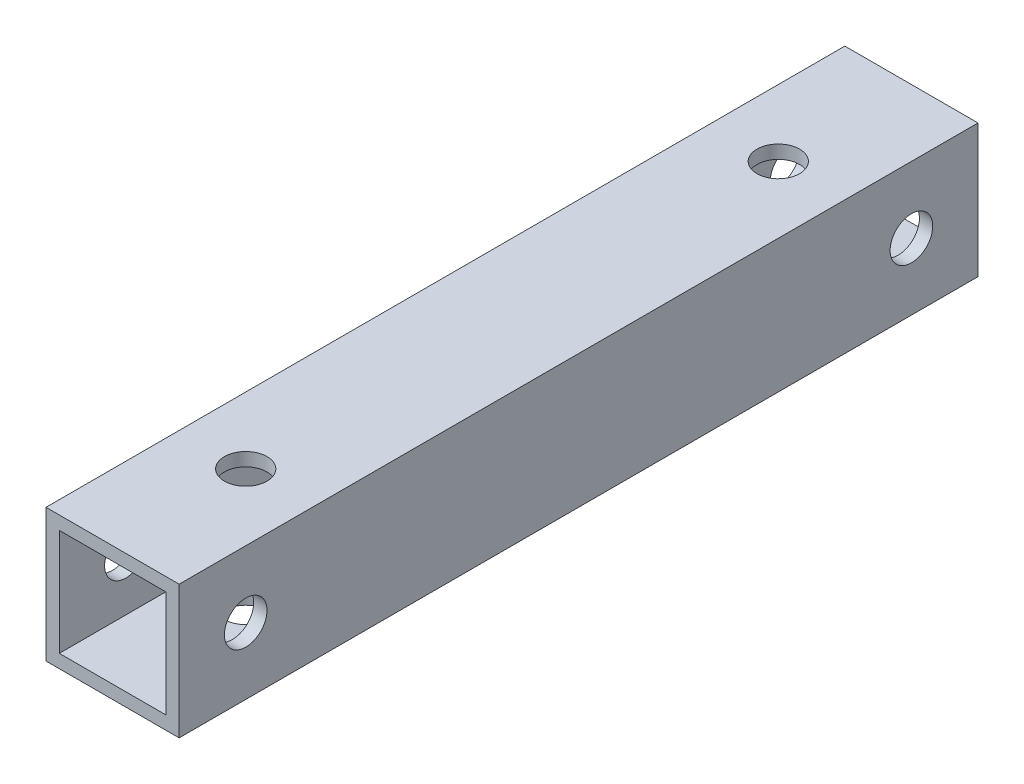
ISO-10303-21;
HEADER;
FILE_DESCRIPTION(('STEP AP214'),'2;1');
FILE_NAME('part.step','',(''),(''),'','','');
FILE_SCHEMA(('AUTOMOTIVE_DESIGN { 1 0 10303 214 1 1 1 1 }'));
ENDSEC;
DATA;
#1=APPLICATION_CONTEXT('core data for automotive mechanical design processes');
#2=APPLICATION_PROTOCOL_DEFINITION('international standard','automotive_design',2000,#1);
#3=PRODUCT_CONTEXT('',#1,'mechanical');
#4=PRODUCT('Part','Part','',(#3));
#5=PRODUCT_RELATED_PRODUCT_CATEGORY('part','',(#4));
#6=PRODUCT_DEFINITION_FORMATION('','',#4);
#7=PRODUCT_DEFINITION_CONTEXT('part definition',#1,'design');
#8=PRODUCT_DEFINITION('design','',#6,#7);
#9=PRODUCT_DEFINITION_SHAPE('','',#8);
#10=(LENGTH_UNIT() NAMED_UNIT(*) SI_UNIT(.MILLI.,.METRE.));
#11=(NAMED_UNIT(*) PLANE_ANGLE_UNIT() SI_UNIT($,.RADIAN.));
#12=(NAMED_UNIT(*) SI_UNIT($,.STERADIAN.) SOLID_ANGLE_UNIT());
#13=UNCERTAINTY_MEASURE_WITH_UNIT(LENGTH_MEASURE(1.E-05),#10,'distance_accuracy_value','');
#14=(GEOMETRIC_REPRESENTATION_CONTEXT(3) GLOBAL_UNCERTAINTY_ASSIGNED_CONTEXT((#13)) GLOBAL_UNIT_ASSIGNED_CONTEXT((#10,
#11,#12)) REPRESENTATION_CONTEXT('',''));
#15=CARTESIAN_POINT('',(0.,0.,0.));
#16=DIRECTION('',(0.,0.,1.));
#17=DIRECTION('',(1.,0.,0.));
#18=AXIS2_PLACEMENT_3D('',#15,#16,#17);
#19=CARTESIAN_POINT('',(0.,0.,30.));
#20=DIRECTION('',(0.,0.,-1.));
#21=DIRECTION('',(-1.,0.,0.));
#22=AXIS2_PLACEMENT_3D('',#19,#20,#21);
#23=PLANE('',#22);
#24=DIRECTION('',(0.,1.,0.));
#25=VECTOR('',#24,1.);
#26=CARTESIAN_POINT('',(5.,-5.,30.));
#27=LINE('',#26,#25);
#28=CARTESIAN_POINT('',(5.,-5.,30.));
#29=VERTEX_POINT('',#28);
#30=CARTESIAN_POINT('',(5.,5.,30.));
#31=VERTEX_POINT('',#30);
#32=EDGE_CURVE('E137',#29,#31,#27,.T.);
#33=ORIENTED_EDGE('',*,*,#32,.T.);
#34=DIRECTION('',(-1.,0.,0.));
#35=VECTOR('',#34,1.);
#36=CARTESIAN_POINT('',(-5.,5.,30.));
#37=LINE('',#36,#35);
#38=CARTESIAN_POINT('',(-5.,5.,30.));
#39=VERTEX_POINT('',#38);
#40=EDGE_CURVE('E140',#31,#39,#37,.T.);
#41=ORIENTED_EDGE('',*,*,#40,.T.);
#42=DIRECTION('',(0.,-1.,0.));
#43=VECTOR('',#42,1.);
#44=CARTESIAN_POINT('',(-5.,-5.,30.));
#45=LINE('',#44,#43);
#46=CARTESIAN_POINT('',(-5.,-5.,30.));
#47=VERTEX_POINT('',#46);
#48=EDGE_CURVE('E143',#39,#47,#45,.T.);
#49=ORIENTED_EDGE('',*,*,#48,.T.);
#50=DIRECTION('',(1.,0.,0.));
#51=VECTOR('',#50,1.);
#52=CARTESIAN_POINT('',(-5.,-5.,30.));
#53=LINE('',#52,#51);
#54=EDGE_CURVE('E145',#47,#29,#53,.T.);
#55=ORIENTED_EDGE('',*,*,#54,.T.);
#56=EDGE_LOOP('',(#33,#41,#49,#55));
#57=FACE_BOUND('',#56,.T.);
#58=DIRECTION('',(0.,1.,0.));
#59=VECTOR('',#58,1.);
#60=CARTESIAN_POINT('',(4.,-4.,30.));
#61=LINE('',#60,#59);
#62=CARTESIAN_POINT('',(4.,-4.,30.));
#63=VERTEX_POINT('',#62);
#64=CARTESIAN_POINT('',(4.,4.,30.));
#65=VERTEX_POINT('',#64);
#66=EDGE_CURVE('E99',#63,#65,#61,.T.);
#67=ORIENTED_EDGE('',*,*,#66,.F.);
#68=DIRECTION('',(1.,0.,0.));
#69=VECTOR('',#68,1.);
#70=CARTESIAN_POINT('',(-4.,-4.,30.));
#71=LINE('',#70,#69);
#72=CARTESIAN_POINT('',(-4.,-4.,30.));
#73=VERTEX_POINT('',#72);
#74=EDGE_CURVE('E121',#73,#63,#71,.T.);
#75=ORIENTED_EDGE('',*,*,#74,.F.);
#76=DIRECTION('',(0.,-1.,0.));
#77=VECTOR('',#76,1.);
#78=CARTESIAN_POINT('',(-4.,-4.,30.));
#79=LINE('',#78,#77);
#80=CARTESIAN_POINT('',(-4.,4.,30.));
#81=VERTEX_POINT('',#80);
#82=EDGE_CURVE('E119',#81,#73,#79,.T.);
#83=ORIENTED_EDGE('',*,*,#82,.F.);
#84=DIRECTION('',(-1.,0.,0.));
#85=VECTOR('',#84,1.);
#86=CARTESIAN_POINT('',(-4.,4.,30.));
#87=LINE('',#86,#85);
#88=EDGE_CURVE('E107',#65,#81,#87,.T.);
#89=ORIENTED_EDGE('',*,*,#88,.F.);
#90=EDGE_LOOP('',(#67,#75,#83,#89));
#91=FACE_BOUND('',#90,.T.);
#92=ADVANCED_FACE('F32',(#57,#91),#23,.F.);
#93=CARTESIAN_POINT('',(0.,0.,-30.));
#94=DIRECTION('',(0.,0.,-1.));
#95=DIRECTION('',(-1.,0.,0.));
#96=AXIS2_PLACEMENT_3D('',#93,#94,#95);
#97=PLANE('',#96);
#98=DIRECTION('',(0.,1.,0.));
#99=VECTOR('',#98,1.);
#100=CARTESIAN_POINT('',(5.,-5.,-30.));
#101=LINE('',#100,#99);
#102=CARTESIAN_POINT('',(5.,-5.,-30.));
#103=VERTEX_POINT('',#102);
#104=CARTESIAN_POINT('',(5.,5.,-30.));
#105=VERTEX_POINT('',#104);
#106=EDGE_CURVE('E115',#103,#105,#101,.T.);
#107=ORIENTED_EDGE('',*,*,#106,.F.);
#108=DIRECTION('',(1.,0.,0.));
#109=VECTOR('',#108,1.);
#110=CARTESIAN_POINT('',(-5.,-5.,-30.));
#111=LINE('',#110,#109);
#112=CARTESIAN_POINT('',(-5.,-5.,-30.));
#113=VERTEX_POINT('',#112);
#114=EDGE_CURVE('E141',#113,#103,#111,.T.);
#115=ORIENTED_EDGE('',*,*,#114,.F.);
#116=DIRECTION('',(0.,-1.,0.));
#117=VECTOR('',#116,1.);
#118=CARTESIAN_POINT('',(-5.,-5.,-30.));
#119=LINE('',#118,#117);
#120=CARTESIAN_POINT('',(-5.,5.,-30.));
#121=VERTEX_POINT('',#120);
#122=EDGE_CURVE('E152',#121,#113,#119,.T.);
#123=ORIENTED_EDGE('',*,*,#122,.F.);
#124=DIRECTION('',(-1.,0.,0.));
#125=VECTOR('',#124,1.);
#126=CARTESIAN_POINT('',(-5.,5.,-30.));
#127=LINE('',#126,#125);
#128=EDGE_CURVE('E150',#105,#121,#127,.T.);
#129=ORIENTED_EDGE('',*,*,#128,.F.);
#130=EDGE_LOOP('',(#107,#115,#123,#129));
#131=FACE_BOUND('',#130,.T.);
#132=DIRECTION('',(1.,0.,0.));
#133=VECTOR('',#132,1.);
#134=CARTESIAN_POINT('',(-4.,-4.,-30.));
#135=LINE('',#134,#133);
#136=CARTESIAN_POINT('',(-4.,-4.,-30.));
#137=VERTEX_POINT('',#136);
#138=CARTESIAN_POINT('',(4.,-4.,-30.));
#139=VERTEX_POINT('',#138);
#140=EDGE_CURVE('E108',#137,#139,#135,.T.);
#141=ORIENTED_EDGE('',*,*,#140,.T.);
#142=DIRECTION('',(0.,1.,0.));
#143=VECTOR('',#142,1.);
#144=CARTESIAN_POINT('',(4.,-4.,-30.));
#145=LINE('',#144,#143);
#146=CARTESIAN_POINT('',(4.,4.,-30.));
#147=VERTEX_POINT('',#146);
#148=EDGE_CURVE('E57',#139,#147,#145,.T.);
#149=ORIENTED_EDGE('',*,*,#148,.T.);
#150=DIRECTION('',(-1.,0.,0.));
#151=VECTOR('',#150,1.);
#152=CARTESIAN_POINT('',(-4.,4.,-30.));
#153=LINE('',#152,#151);
#154=CARTESIAN_POINT('',(-4.,4.,-30.));
#155=VERTEX_POINT('',#154);
#156=EDGE_CURVE('E114',#147,#155,#153,.T.);
#157=ORIENTED_EDGE('',*,*,#156,.T.);
#158=DIRECTION('',(0.,-1.,0.));
#159=VECTOR('',#158,1.);
#160=CARTESIAN_POINT('',(-4.,-4.,-30.));
#161=LINE('',#160,#159);
#162=EDGE_CURVE('E129',#155,#137,#161,.T.);
#163=ORIENTED_EDGE('',*,*,#162,.T.);
#164=EDGE_LOOP('',(#141,#149,#157,#163));
#165=FACE_BOUND('',#164,.T.);
#166=ADVANCED_FACE('F229',(#131,#165),#97,.T.);
#167=CARTESIAN_POINT('',(5.,-5.,30.));
#168=DIRECTION('',(-1.,0.,0.));
#169=DIRECTION('',(0.,0.,1.));
#170=AXIS2_PLACEMENT_3D('',#167,#168,#169);
#171=PLANE('',#170);
#172=CARTESIAN_POINT('',(5.,0.,25.));
#173=DIRECTION('',(1.,0.,0.));
#174=DIRECTION('',(0.,0.,-1.));
#175=AXIS2_PLACEMENT_3D('',#172,#173,#174);
#176=CIRCLE('',#175,1.6);
#177=CARTESIAN_POINT('',(5.,0.,23.4));
#178=VERTEX_POINT('',#177);
#179=EDGE_CURVE('E197',#178,#178,#176,.T.);
#180=ORIENTED_EDGE('',*,*,#179,.F.);
#181=EDGE_LOOP('',(#180));
#182=FACE_BOUND('',#181,.T.);
#183=CARTESIAN_POINT('',(5.,0.,-25.));
#184=DIRECTION('',(1.,0.,0.));
#185=DIRECTION('',(0.,0.,-1.));
#186=AXIS2_PLACEMENT_3D('',#183,#184,#185);
#187=CIRCLE('',#186,1.6);
#188=CARTESIAN_POINT('',(5.,0.,-26.6));
#189=VERTEX_POINT('',#188);
#190=EDGE_CURVE('E194',#189,#189,#187,.T.);
#191=ORIENTED_EDGE('',*,*,#190,.F.);
#192=EDGE_LOOP('',(#191));
#193=FACE_BOUND('',#192,.T.);
#194=ORIENTED_EDGE('',*,*,#106,.T.);
#195=DIRECTION('',(0.,0.,-1.));
#196=VECTOR('',#195,1.);
#197=CARTESIAN_POINT('',(5.,5.,30.));
#198=LINE('',#197,#196);
#199=EDGE_CURVE('E11',#31,#105,#198,.T.);
#200=ORIENTED_EDGE('',*,*,#199,.F.);
#201=ORIENTED_EDGE('',*,*,#32,.F.);
#202=DIRECTION('',(0.,0.,-1.));
#203=VECTOR('',#202,1.);
#204=CARTESIAN_POINT('',(5.,-5.,30.));
#205=LINE('',#204,#203);
#206=EDGE_CURVE('E147',#29,#103,#205,.T.);
#207=ORIENTED_EDGE('',*,*,#206,.T.);
#208=EDGE_LOOP('',(#194,#200,#201,#207));
#209=FACE_BOUND('',#208,.T.);
#210=ADVANCED_FACE('F34',(#182,#193,#209),#171,.F.);
#211=CARTESIAN_POINT('',(-5.,5.,30.));
#212=DIRECTION('',(0.,-1.,0.));
#213=DIRECTION('',(0.,0.,-1.));
#214=AXIS2_PLACEMENT_3D('',#211,#212,#213);
#215=PLANE('',#214);
#216=CARTESIAN_POINT('',(0.,5.,20.));
#217=DIRECTION('',(0.,1.,0.));
#218=DIRECTION('',(0.,0.,1.));
#219=AXIS2_PLACEMENT_3D('',#216,#217,#218);
#220=CIRCLE('',#219,1.6);
#221=CARTESIAN_POINT('',(0.,5.,21.6));
#222=VERTEX_POINT('',#221);
#223=EDGE_CURVE('E178',#222,#222,#220,.T.);
#224=ORIENTED_EDGE('',*,*,#223,.F.);
#225=EDGE_LOOP('',(#224));
#226=FACE_BOUND('',#225,.T.);
#227=CARTESIAN_POINT('',(0.,5.,-20.));
#228=DIRECTION('',(0.,1.,0.));
#229=DIRECTION('',(0.,0.,1.));
#230=AXIS2_PLACEMENT_3D('',#227,#228,#229);
#231=CIRCLE('',#230,1.6);
#232=CARTESIAN_POINT('',(0.,5.,-18.4));
#233=VERTEX_POINT('',#232);
#234=EDGE_CURVE('E188',#233,#233,#231,.T.);
#235=ORIENTED_EDGE('',*,*,#234,.F.);
#236=EDGE_LOOP('',(#235));
#237=FACE_BOUND('',#236,.T.);
#238=ORIENTED_EDGE('',*,*,#128,.T.);
#239=DIRECTION('',(0.,0.,-1.));
#240=VECTOR('',#239,1.);
#241=CARTESIAN_POINT('',(-5.,5.,30.));
#242=LINE('',#241,#240);
#243=EDGE_CURVE('E41',#39,#121,#242,.T.);
#244=ORIENTED_EDGE('',*,*,#243,.F.);
#245=ORIENTED_EDGE('',*,*,#40,.F.);
#246=ORIENTED_EDGE('',*,*,#199,.T.);
#247=EDGE_LOOP('',(#238,#244,#245,#246));
#248=FACE_BOUND('',#247,.T.);
#249=ADVANCED_FACE('F228',(#226,#237,#248),#215,.F.);
#250=CARTESIAN_POINT('',(-5.,-5.,30.));
#251=DIRECTION('',(1.,0.,0.));
#252=DIRECTION('',(0.,1.,0.));
#253=AXIS2_PLACEMENT_3D('',#250,#251,#252);
#254=PLANE('',#253);
#255=CARTESIAN_POINT('',(-5.,0.,25.));
#256=DIRECTION('',(1.,0.,0.));
#257=DIRECTION('',(0.,0.,-1.));
#258=AXIS2_PLACEMENT_3D('',#255,#256,#257);
#259=CIRCLE('',#258,1.6);
#260=CARTESIAN_POINT('',(-5.,0.,23.4));
#261=VERTEX_POINT('',#260);
#262=EDGE_CURVE('E166',#261,#261,#259,.T.);
#263=ORIENTED_EDGE('',*,*,#262,.T.);
#264=EDGE_LOOP('',(#263));
#265=FACE_BOUND('',#264,.T.);
#266=CARTESIAN_POINT('',(-5.,0.,-25.));
#267=DIRECTION('',(1.,0.,0.));
#268=DIRECTION('',(0.,0.,-1.));
#269=AXIS2_PLACEMENT_3D('',#266,#267,#268);
#270=CIRCLE('',#269,1.6);
#271=CARTESIAN_POINT('',(-5.,0.,-26.6));
#272=VERTEX_POINT('',#271);
#273=EDGE_CURVE('E200',#272,#272,#270,.T.);
#274=ORIENTED_EDGE('',*,*,#273,.T.);
#275=EDGE_LOOP('',(#274));
#276=FACE_BOUND('',#275,.T.);
#277=ORIENTED_EDGE('',*,*,#122,.T.);
#278=DIRECTION('',(0.,0.,-1.));
#279=VECTOR('',#278,1.);
#280=CARTESIAN_POINT('',(-5.,-5.,30.));
#281=LINE('',#280,#279);
#282=EDGE_CURVE('E157',#47,#113,#281,.T.);
#283=ORIENTED_EDGE('',*,*,#282,.F.);
#284=ORIENTED_EDGE('',*,*,#48,.F.);
#285=ORIENTED_EDGE('',*,*,#243,.T.);
#286=EDGE_LOOP('',(#277,#283,#284,#285));
#287=FACE_BOUND('',#286,.T.);
#288=ADVANCED_FACE('F247',(#265,#276,#287),#254,.F.);
#289=CARTESIAN_POINT('',(-5.,-5.,30.));
#290=DIRECTION('',(0.,1.,0.));
#291=DIRECTION('',(-1.,0.,0.));
#292=AXIS2_PLACEMENT_3D('',#289,#290,#291);
#293=PLANE('',#292);
#294=CARTESIAN_POINT('',(0.,-5.,20.));
#295=DIRECTION('',(0.,1.,0.));
#296=DIRECTION('',(0.,0.,1.));
#297=AXIS2_PLACEMENT_3D('',#294,#295,#296);
#298=CIRCLE('',#297,1.6);
#299=CARTESIAN_POINT('',(0.,-5.,21.6));
#300=VERTEX_POINT('',#299);
#301=EDGE_CURVE('E172',#300,#300,#298,.T.);
#302=ORIENTED_EDGE('',*,*,#301,.T.);
#303=EDGE_LOOP('',(#302));
#304=FACE_BOUND('',#303,.T.);
#305=CARTESIAN_POINT('',(0.,-5.,-20.));
#306=DIRECTION('',(0.,1.,0.));
#307=DIRECTION('',(0.,0.,1.));
#308=AXIS2_PLACEMENT_3D('',#305,#306,#307);
#309=CIRCLE('',#308,1.6);
#310=CARTESIAN_POINT('',(0.,-5.,-18.4));
#311=VERTEX_POINT('',#310);
#312=EDGE_CURVE('E183',#311,#311,#309,.T.);
#313=ORIENTED_EDGE('',*,*,#312,.T.);
#314=EDGE_LOOP('',(#313));
#315=FACE_BOUND('',#314,.T.);
#316=ORIENTED_EDGE('',*,*,#114,.T.);
#317=ORIENTED_EDGE('',*,*,#206,.F.);
#318=ORIENTED_EDGE('',*,*,#54,.F.);
#319=ORIENTED_EDGE('',*,*,#282,.T.);
#320=EDGE_LOOP('',(#316,#317,#318,#319));
#321=FACE_BOUND('',#320,.T.);
#322=ADVANCED_FACE('F214',(#304,#315,#321),#293,.F.);
#323=CARTESIAN_POINT('',(4.,-4.,30.));
#324=DIRECTION('',(-1.,0.,0.));
#325=DIRECTION('',(0.,0.,1.));
#326=AXIS2_PLACEMENT_3D('',#323,#324,#325);
#327=PLANE('',#326);
#328=CARTESIAN_POINT('',(4.,0.,25.));
#329=DIRECTION('',(-1.,0.,0.));
#330=DIRECTION('',(0.,0.,1.));
#331=AXIS2_PLACEMENT_3D('',#328,#329,#330);
#332=CIRCLE('',#331,1.6);
#333=CARTESIAN_POINT('',(4.,0.,26.6));
#334=VERTEX_POINT('',#333);
#335=EDGE_CURVE('E127',#334,#334,#332,.T.);
#336=ORIENTED_EDGE('',*,*,#335,.F.);
#337=EDGE_LOOP('',(#336));
#338=FACE_BOUND('',#337,.T.);
#339=CARTESIAN_POINT('',(4.,0.,-25.));
#340=DIRECTION('',(-1.,0.,0.));
#341=DIRECTION('',(0.,0.,1.));
#342=AXIS2_PLACEMENT_3D('',#339,#340,#341);
#343=CIRCLE('',#342,1.6);
#344=CARTESIAN_POINT('',(4.,0.,-23.4));
#345=VERTEX_POINT('',#344);
#346=EDGE_CURVE('E165',#345,#345,#343,.T.);
#347=ORIENTED_EDGE('',*,*,#346,.F.);
#348=EDGE_LOOP('',(#347));
#349=FACE_BOUND('',#348,.T.);
#350=ORIENTED_EDGE('',*,*,#148,.F.);
#351=DIRECTION('',(0.,0.,-1.));
#352=VECTOR('',#351,1.);
#353=CARTESIAN_POINT('',(4.,-4.,30.));
#354=LINE('',#353,#352);
#355=EDGE_CURVE('E103',#63,#139,#354,.T.);
#356=ORIENTED_EDGE('',*,*,#355,.F.);
#357=ORIENTED_EDGE('',*,*,#66,.T.);
#358=DIRECTION('',(0.,0.,-1.));
#359=VECTOR('',#358,1.);
#360=CARTESIAN_POINT('',(4.,4.,30.));
#361=LINE('',#360,#359);
#362=EDGE_CURVE('E102',#65,#147,#361,.T.);
#363=ORIENTED_EDGE('',*,*,#362,.T.);
#364=EDGE_LOOP('',(#350,#356,#357,#363));
#365=FACE_BOUND('',#364,.T.);
#366=ADVANCED_FACE('F101',(#338,#349,#365),#327,.T.);
#367=CARTESIAN_POINT('',(-4.,4.,30.));
#368=DIRECTION('',(0.,-1.,0.));
#369=DIRECTION('',(0.,0.,-1.));
#370=AXIS2_PLACEMENT_3D('',#367,#368,#369);
#371=PLANE('',#370);
#372=CARTESIAN_POINT('',(0.,4.,20.));
#373=DIRECTION('',(0.,-1.,0.));
#374=DIRECTION('',(0.,0.,-1.));
#375=AXIS2_PLACEMENT_3D('',#372,#373,#374);
#376=CIRCLE('',#375,1.6);
#377=CARTESIAN_POINT('',(0.,4.,18.4));
#378=VERTEX_POINT('',#377);
#379=EDGE_CURVE('E191',#378,#378,#376,.T.);
#380=ORIENTED_EDGE('',*,*,#379,.F.);
#381=EDGE_LOOP('',(#380));
#382=FACE_BOUND('',#381,.T.);
#383=CARTESIAN_POINT('',(0.,4.,-20.));
#384=DIRECTION('',(0.,-1.,0.));
#385=DIRECTION('',(0.,0.,-1.));
#386=AXIS2_PLACEMENT_3D('',#383,#384,#385);
#387=CIRCLE('',#386,1.6);
#388=CARTESIAN_POINT('',(0.,4.,-21.6));
#389=VERTEX_POINT('',#388);
#390=EDGE_CURVE('E171',#389,#389,#387,.T.);
#391=ORIENTED_EDGE('',*,*,#390,.F.);
#392=EDGE_LOOP('',(#391));
#393=FACE_BOUND('',#392,.T.);
#394=ORIENTED_EDGE('',*,*,#156,.F.);
#395=ORIENTED_EDGE('',*,*,#362,.F.);
#396=ORIENTED_EDGE('',*,*,#88,.T.);
#397=DIRECTION('',(0.,0.,-1.));
#398=VECTOR('',#397,1.);
#399=CARTESIAN_POINT('',(-4.,4.,30.));
#400=LINE('',#399,#398);
#401=EDGE_CURVE('E116',#81,#155,#400,.T.);
#402=ORIENTED_EDGE('',*,*,#401,.T.);
#403=EDGE_LOOP('',(#394,#395,#396,#402));
#404=FACE_BOUND('',#403,.T.);
#405=ADVANCED_FACE('F111',(#382,#393,#404),#371,.T.);
#406=CARTESIAN_POINT('',(-4.,-4.,30.));
#407=DIRECTION('',(1.,0.,0.));
#408=DIRECTION('',(0.,0.,-1.));
#409=AXIS2_PLACEMENT_3D('',#406,#407,#408);
#410=PLANE('',#409);
#411=CARTESIAN_POINT('',(-4.,0.,25.));
#412=DIRECTION('',(1.,0.,0.));
#413=DIRECTION('',(0.,0.,-1.));
#414=AXIS2_PLACEMENT_3D('',#411,#412,#413);
#415=CIRCLE('',#414,1.6);
#416=CARTESIAN_POINT('',(-4.,0.,23.4));
#417=VERTEX_POINT('',#416);
#418=EDGE_CURVE('E167',#417,#417,#415,.T.);
#419=ORIENTED_EDGE('',*,*,#418,.F.);
#420=EDGE_LOOP('',(#419));
#421=FACE_BOUND('',#420,.T.);
#422=CARTESIAN_POINT('',(-4.,0.,-25.));
#423=DIRECTION('',(1.,0.,0.));
#424=DIRECTION('',(0.,0.,-1.));
#425=AXIS2_PLACEMENT_3D('',#422,#423,#424);
#426=CIRCLE('',#425,1.6);
#427=CARTESIAN_POINT('',(-4.,0.,-26.6));
#428=VERTEX_POINT('',#427);
#429=EDGE_CURVE('E162',#428,#428,#426,.T.);
#430=ORIENTED_EDGE('',*,*,#429,.F.);
#431=EDGE_LOOP('',(#430));
#432=FACE_BOUND('',#431,.T.);
#433=ORIENTED_EDGE('',*,*,#162,.F.);
#434=ORIENTED_EDGE('',*,*,#401,.F.);
#435=ORIENTED_EDGE('',*,*,#82,.T.);
#436=DIRECTION('',(0.,0.,-1.));
#437=VECTOR('',#436,1.);
#438=CARTESIAN_POINT('',(-4.,-4.,30.));
#439=LINE('',#438,#437);
#440=EDGE_CURVE('E49',#73,#137,#439,.T.);
#441=ORIENTED_EDGE('',*,*,#440,.T.);
#442=EDGE_LOOP('',(#433,#434,#435,#441));
#443=FACE_BOUND('',#442,.T.);
#444=ADVANCED_FACE('F267',(#421,#432,#443),#410,.T.);
#445=CARTESIAN_POINT('',(-4.,-4.,30.));
#446=DIRECTION('',(0.,1.,0.));
#447=DIRECTION('',(0.,0.,1.));
#448=AXIS2_PLACEMENT_3D('',#445,#446,#447);
#449=PLANE('',#448);
#450=CARTESIAN_POINT('',(0.,-4.,20.));
#451=DIRECTION('',(0.,1.,0.));
#452=DIRECTION('',(0.,0.,1.));
#453=AXIS2_PLACEMENT_3D('',#450,#451,#452);
#454=CIRCLE('',#453,1.6);
#455=CARTESIAN_POINT('',(0.,-4.,21.6));
#456=VERTEX_POINT('',#455);
#457=EDGE_CURVE('E36',#456,#456,#454,.T.);
#458=ORIENTED_EDGE('',*,*,#457,.F.);
#459=EDGE_LOOP('',(#458));
#460=FACE_BOUND('',#459,.T.);
#461=CARTESIAN_POINT('',(0.,-4.,-20.));
#462=DIRECTION('',(0.,1.,0.));
#463=DIRECTION('',(0.,0.,1.));
#464=AXIS2_PLACEMENT_3D('',#461,#462,#463);
#465=CIRCLE('',#464,1.6);
#466=CARTESIAN_POINT('',(0.,-4.,-18.4));
#467=VERTEX_POINT('',#466);
#468=EDGE_CURVE('E169',#467,#467,#465,.T.);
#469=ORIENTED_EDGE('',*,*,#468,.F.);
#470=EDGE_LOOP('',(#469));
#471=FACE_BOUND('',#470,.T.);
#472=ORIENTED_EDGE('',*,*,#140,.F.);
#473=ORIENTED_EDGE('',*,*,#440,.F.);
#474=ORIENTED_EDGE('',*,*,#74,.T.);
#475=ORIENTED_EDGE('',*,*,#355,.T.);
#476=EDGE_LOOP('',(#472,#473,#474,#475));
#477=FACE_BOUND('',#476,.T.);
#478=ADVANCED_FACE('F271',(#460,#471,#477),#449,.T.);
#479=CARTESIAN_POINT('',(-5.,0.,-25.));
#480=DIRECTION('',(1.,0.,0.));
#481=DIRECTION('',(0.,0.,-1.));
#482=AXIS2_PLACEMENT_3D('',#479,#480,#481);
#483=CYLINDRICAL_SURFACE('',#482,1.6);
#484=ORIENTED_EDGE('',*,*,#429,.T.);
#485=EDGE_LOOP('',(#484));
#486=FACE_BOUND('',#485,.T.);
#487=ORIENTED_EDGE('',*,*,#273,.F.);
#488=EDGE_LOOP('',(#487));
#489=FACE_BOUND('',#488,.T.);
#490=ADVANCED_FACE('F223',(#486,#489),#483,.F.);
#491=CARTESIAN_POINT('',(-5.,0.,25.));
#492=DIRECTION('',(1.,0.,0.));
#493=DIRECTION('',(0.,0.,-1.));
#494=AXIS2_PLACEMENT_3D('',#491,#492,#493);
#495=CYLINDRICAL_SURFACE('',#494,1.6);
#496=ORIENTED_EDGE('',*,*,#418,.T.);
#497=EDGE_LOOP('',(#496));
#498=FACE_BOUND('',#497,.T.);
#499=ORIENTED_EDGE('',*,*,#262,.F.);
#500=EDGE_LOOP('',(#499));
#501=FACE_BOUND('',#500,.T.);
#502=ADVANCED_FACE('F221',(#498,#501),#495,.F.);
#503=ORIENTED_EDGE('',*,*,#346,.T.);
#504=EDGE_LOOP('',(#503));
#505=FACE_BOUND('',#504,.T.);
#506=ORIENTED_EDGE('',*,*,#190,.T.);
#507=EDGE_LOOP('',(#506));
#508=FACE_BOUND('',#507,.T.);
#509=ADVANCED_FACE('F218',(#505,#508),#483,.F.);
#510=ORIENTED_EDGE('',*,*,#335,.T.);
#511=EDGE_LOOP('',(#510));
#512=FACE_BOUND('',#511,.T.);
#513=ORIENTED_EDGE('',*,*,#179,.T.);
#514=EDGE_LOOP('',(#513));
#515=FACE_BOUND('',#514,.T.);
#516=ADVANCED_FACE('F209',(#512,#515),#495,.F.);
#517=CARTESIAN_POINT('',(0.,-5.,-20.));
#518=DIRECTION('',(0.,1.,0.));
#519=DIRECTION('',(0.,0.,1.));
#520=AXIS2_PLACEMENT_3D('',#517,#518,#519);
#521=CYLINDRICAL_SURFACE('',#520,1.6);
#522=ORIENTED_EDGE('',*,*,#468,.T.);
#523=EDGE_LOOP('',(#522));
#524=FACE_BOUND('',#523,.T.);
#525=ORIENTED_EDGE('',*,*,#312,.F.);
#526=EDGE_LOOP('',(#525));
#527=FACE_BOUND('',#526,.T.);
#528=ADVANCED_FACE('F281',(#524,#527),#521,.F.);
#529=CARTESIAN_POINT('',(0.,-5.,20.));
#530=DIRECTION('',(0.,1.,0.));
#531=DIRECTION('',(0.,0.,1.));
#532=AXIS2_PLACEMENT_3D('',#529,#530,#531);
#533=CYLINDRICAL_SURFACE('',#532,1.6);
#534=ORIENTED_EDGE('',*,*,#457,.T.);
#535=EDGE_LOOP('',(#534));
#536=FACE_BOUND('',#535,.T.);
#537=ORIENTED_EDGE('',*,*,#301,.F.);
#538=EDGE_LOOP('',(#537));
#539=FACE_BOUND('',#538,.T.);
#540=ADVANCED_FACE('F284',(#536,#539),#533,.F.);
#541=ORIENTED_EDGE('',*,*,#390,.T.);
#542=EDGE_LOOP('',(#541));
#543=FACE_BOUND('',#542,.T.);
#544=ORIENTED_EDGE('',*,*,#234,.T.);
#545=EDGE_LOOP('',(#544));
#546=FACE_BOUND('',#545,.T.);
#547=ADVANCED_FACE('F285',(#543,#546),#521,.F.);
#548=ORIENTED_EDGE('',*,*,#379,.T.);
#549=EDGE_LOOP('',(#548));
#550=FACE_BOUND('',#549,.T.);
#551=ORIENTED_EDGE('',*,*,#223,.T.);
#552=EDGE_LOOP('',(#551));
#553=FACE_BOUND('',#552,.T.);
#554=ADVANCED_FACE('F288',(#550,#553),#533,.F.);
#555=CLOSED_SHELL('',(#92,#166,#210,#249,#288,#322,#366,#405,#444,#478,#490,#502,#509,#516,#528,
#540,#547,#554));
#556=MANIFOLD_SOLID_BREP('B2',#555);
#557=ADVANCED_BREP_SHAPE_REPRESENTATION('',(#18,#556),#14);
#558=SHAPE_DEFINITION_REPRESENTATION(#9,#557);
ENDSEC;
END-ISO-10303-21;
